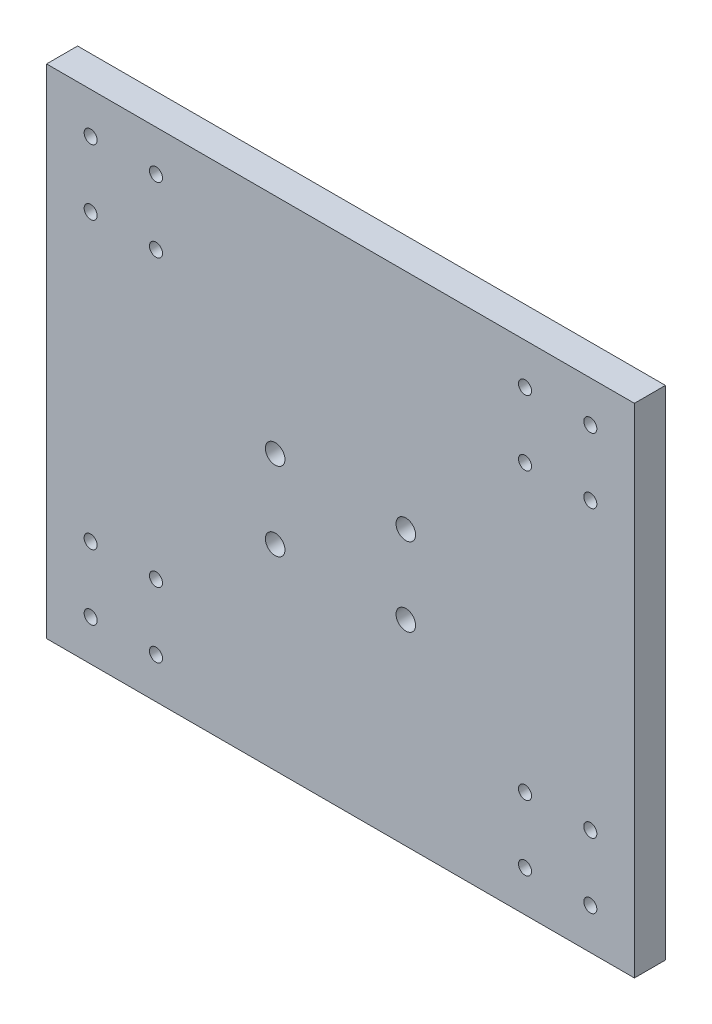
ISO-10303-21;
HEADER;
FILE_DESCRIPTION(('STEP AP214'),'2;1');
FILE_NAME('part.step','',(''),(''),'','','');
FILE_SCHEMA(('AUTOMOTIVE_DESIGN { 1 0 10303 214 1 1 1 1 }'));
ENDSEC;
DATA;
#1=APPLICATION_CONTEXT('core data for automotive mechanical design processes');
#2=APPLICATION_PROTOCOL_DEFINITION('international standard','automotive_design',2000,#1);
#3=PRODUCT_CONTEXT('',#1,'mechanical');
#4=PRODUCT('Part','Part','',(#3));
#5=PRODUCT_RELATED_PRODUCT_CATEGORY('part','',(#4));
#6=PRODUCT_DEFINITION_FORMATION('','',#4);
#7=PRODUCT_DEFINITION_CONTEXT('part definition',#1,'design');
#8=PRODUCT_DEFINITION('design','',#6,#7);
#9=PRODUCT_DEFINITION_SHAPE('','',#8);
#10=(LENGTH_UNIT() NAMED_UNIT(*) SI_UNIT(.MILLI.,.METRE.));
#11=(NAMED_UNIT(*) PLANE_ANGLE_UNIT() SI_UNIT($,.RADIAN.));
#12=(NAMED_UNIT(*) SI_UNIT($,.STERADIAN.) SOLID_ANGLE_UNIT());
#13=UNCERTAINTY_MEASURE_WITH_UNIT(LENGTH_MEASURE(1.E-05),#10,'distance_accuracy_value','');
#14=(GEOMETRIC_REPRESENTATION_CONTEXT(3) GLOBAL_UNCERTAINTY_ASSIGNED_CONTEXT((#13)) GLOBAL_UNIT_ASSIGNED_CONTEXT((#10,
#11,#12)) REPRESENTATION_CONTEXT('',''));
#15=CARTESIAN_POINT('',(0.,0.,0.));
#16=DIRECTION('',(0.,0.,1.));
#17=DIRECTION('',(1.,0.,0.));
#18=AXIS2_PLACEMENT_3D('',#15,#16,#17);
#19=CARTESIAN_POINT('',(90.,-76.2,9.5));
#20=DIRECTION('',(-1.,0.,0.));
#21=DIRECTION('',(0.,0.,1.));
#22=AXIS2_PLACEMENT_3D('',#19,#20,#21);
#23=PLANE('',#22);
#24=DIRECTION('',(0.,1.,0.));
#25=VECTOR('',#24,1.);
#26=CARTESIAN_POINT('',(90.,-76.2,0.));
#27=LINE('',#26,#25);
#28=CARTESIAN_POINT('',(90.,-76.2,0.));
#29=VERTEX_POINT('',#28);
#30=CARTESIAN_POINT('',(90.,76.2,0.));
#31=VERTEX_POINT('',#30);
#32=EDGE_CURVE('E97',#29,#31,#27,.T.);
#33=ORIENTED_EDGE('',*,*,#32,.T.);
#34=DIRECTION('',(0.,0.,-1.));
#35=VECTOR('',#34,1.);
#36=CARTESIAN_POINT('',(90.,76.2,9.5));
#37=LINE('',#36,#35);
#38=CARTESIAN_POINT('',(90.,76.2,9.5));
#39=VERTEX_POINT('',#38);
#40=EDGE_CURVE('E11',#39,#31,#37,.T.);
#41=ORIENTED_EDGE('',*,*,#40,.F.);
#42=DIRECTION('',(0.,1.,0.));
#43=VECTOR('',#42,1.);
#44=CARTESIAN_POINT('',(90.,-76.2,9.5));
#45=LINE('',#44,#43);
#46=CARTESIAN_POINT('',(90.,-76.2,9.5));
#47=VERTEX_POINT('',#46);
#48=EDGE_CURVE('E85',#47,#39,#45,.T.);
#49=ORIENTED_EDGE('',*,*,#48,.F.);
#50=DIRECTION('',(0.,0.,-1.));
#51=VECTOR('',#50,1.);
#52=CARTESIAN_POINT('',(90.,-76.2,9.5));
#53=LINE('',#52,#51);
#54=EDGE_CURVE('E93',#47,#29,#53,.T.);
#55=ORIENTED_EDGE('',*,*,#54,.T.);
#56=EDGE_LOOP('',(#33,#41,#49,#55));
#57=FACE_BOUND('',#56,.T.);
#58=ADVANCED_FACE('F34',(#57),#23,.F.);
#59=CARTESIAN_POINT('',(-90.,76.2,9.5));
#60=DIRECTION('',(0.,-1.,0.));
#61=DIRECTION('',(0.,0.,-1.));
#62=AXIS2_PLACEMENT_3D('',#59,#60,#61);
#63=PLANE('',#62);
#64=DIRECTION('',(-1.,0.,0.));
#65=VECTOR('',#64,1.);
#66=CARTESIAN_POINT('',(-90.,76.2,0.));
#67=LINE('',#66,#65);
#68=CARTESIAN_POINT('',(-90.,76.2,0.));
#69=VERTEX_POINT('',#68);
#70=EDGE_CURVE('E89',#31,#69,#67,.T.);
#71=ORIENTED_EDGE('',*,*,#70,.T.);
#72=DIRECTION('',(0.,0.,-1.));
#73=VECTOR('',#72,1.);
#74=CARTESIAN_POINT('',(-90.,76.2,9.5));
#75=LINE('',#74,#73);
#76=CARTESIAN_POINT('',(-90.,76.2,9.5));
#77=VERTEX_POINT('',#76);
#78=EDGE_CURVE('E42',#77,#69,#75,.T.);
#79=ORIENTED_EDGE('',*,*,#78,.F.);
#80=DIRECTION('',(-1.,0.,0.));
#81=VECTOR('',#80,1.);
#82=CARTESIAN_POINT('',(-90.,76.2,9.5));
#83=LINE('',#82,#81);
#84=EDGE_CURVE('E80',#39,#77,#83,.T.);
#85=ORIENTED_EDGE('',*,*,#84,.F.);
#86=ORIENTED_EDGE('',*,*,#40,.T.);
#87=EDGE_LOOP('',(#71,#79,#85,#86));
#88=FACE_BOUND('',#87,.T.);
#89=ADVANCED_FACE('F88',(#88),#63,.F.);
#90=CARTESIAN_POINT('',(-90.,-76.2,9.5));
#91=DIRECTION('',(1.,0.,0.));
#92=DIRECTION('',(0.,0.,-1.));
#93=AXIS2_PLACEMENT_3D('',#90,#91,#92);
#94=PLANE('',#93);
#95=DIRECTION('',(0.,-1.,0.));
#96=VECTOR('',#95,1.);
#97=CARTESIAN_POINT('',(-90.,-76.2,0.));
#98=LINE('',#97,#96);
#99=CARTESIAN_POINT('',(-90.,-76.2,0.));
#100=VERTEX_POINT('',#99);
#101=EDGE_CURVE('E67',#69,#100,#98,.T.);
#102=ORIENTED_EDGE('',*,*,#101,.T.);
#103=DIRECTION('',(0.,0.,-1.));
#104=VECTOR('',#103,1.);
#105=CARTESIAN_POINT('',(-90.,-76.2,9.5));
#106=LINE('',#105,#104);
#107=CARTESIAN_POINT('',(-90.,-76.2,9.5));
#108=VERTEX_POINT('',#107);
#109=EDGE_CURVE('E90',#108,#100,#106,.T.);
#110=ORIENTED_EDGE('',*,*,#109,.F.);
#111=DIRECTION('',(0.,-1.,0.));
#112=VECTOR('',#111,1.);
#113=CARTESIAN_POINT('',(-90.,-76.2,9.5));
#114=LINE('',#113,#112);
#115=EDGE_CURVE('E83',#77,#108,#114,.T.);
#116=ORIENTED_EDGE('',*,*,#115,.F.);
#117=ORIENTED_EDGE('',*,*,#78,.T.);
#118=EDGE_LOOP('',(#102,#110,#116,#117));
#119=FACE_BOUND('',#118,.T.);
#120=ADVANCED_FACE('F91',(#119),#94,.F.);
#121=CARTESIAN_POINT('',(-90.,-76.2,9.5));
#122=DIRECTION('',(0.,1.,0.));
#123=DIRECTION('',(0.,0.,1.));
#124=AXIS2_PLACEMENT_3D('',#121,#122,#123);
#125=PLANE('',#124);
#126=DIRECTION('',(1.,0.,0.));
#127=VECTOR('',#126,1.);
#128=CARTESIAN_POINT('',(-90.,-76.2,0.));
#129=LINE('',#128,#127);
#130=EDGE_CURVE('E73',#100,#29,#129,.T.);
#131=ORIENTED_EDGE('',*,*,#130,.T.);
#132=ORIENTED_EDGE('',*,*,#54,.F.);
#133=DIRECTION('',(1.,0.,0.));
#134=VECTOR('',#133,1.);
#135=CARTESIAN_POINT('',(-90.,-76.2,9.5));
#136=LINE('',#135,#134);
#137=EDGE_CURVE('E50',#108,#47,#136,.T.);
#138=ORIENTED_EDGE('',*,*,#137,.F.);
#139=ORIENTED_EDGE('',*,*,#109,.T.);
#140=EDGE_LOOP('',(#131,#132,#138,#139));
#141=FACE_BOUND('',#140,.T.);
#142=ADVANCED_FACE('F105',(#141),#125,.F.);
#143=CARTESIAN_POINT('',(0.,0.,9.5));
#144=DIRECTION('',(0.,0.,-1.));
#145=DIRECTION('',(-1.,0.,0.));
#146=AXIS2_PLACEMENT_3D('',#143,#144,#145);
#147=PLANE('',#146);
#148=CARTESIAN_POINT('',(76.4999999999999,63.7,9.5));
#149=DIRECTION('',(0.,0.,1.));
#150=DIRECTION('',(1.,0.,0.));
#151=AXIS2_PLACEMENT_3D('',#148,#149,#150);
#152=CIRCLE('',#151,2.);
#153=CARTESIAN_POINT('',(78.4999999999999,63.7,9.5));
#154=VERTEX_POINT('',#153);
#155=EDGE_CURVE('E196',#154,#154,#152,.T.);
#156=ORIENTED_EDGE('',*,*,#155,.F.);
#157=EDGE_LOOP('',(#156));
#158=FACE_BOUND('',#157,.T.);
#159=CARTESIAN_POINT('',(56.5,63.7,9.5));
#160=DIRECTION('',(0.,0.,1.));
#161=DIRECTION('',(1.,0.,0.));
#162=AXIS2_PLACEMENT_3D('',#159,#160,#161);
#163=CIRCLE('',#162,2.);
#164=CARTESIAN_POINT('',(58.5,63.7,9.5));
#165=VERTEX_POINT('',#164);
#166=EDGE_CURVE('E178',#165,#165,#163,.T.);
#167=ORIENTED_EDGE('',*,*,#166,.F.);
#168=EDGE_LOOP('',(#167));
#169=FACE_BOUND('',#168,.T.);
#170=CARTESIAN_POINT('',(-56.5,43.7,9.5));
#171=DIRECTION('',(0.,0.,1.));
#172=DIRECTION('',(-1.,0.,0.));
#173=AXIS2_PLACEMENT_3D('',#170,#171,#172);
#174=CIRCLE('',#173,2.);
#175=CARTESIAN_POINT('',(-58.5,43.7,9.5));
#176=VERTEX_POINT('',#175);
#177=EDGE_CURVE('E179',#176,#176,#174,.T.);
#178=ORIENTED_EDGE('',*,*,#177,.F.);
#179=EDGE_LOOP('',(#178));
#180=FACE_BOUND('',#179,.T.);
#181=CARTESIAN_POINT('',(-76.4999999999999,63.7,9.5));
#182=DIRECTION('',(0.,0.,1.));
#183=DIRECTION('',(-1.,0.,0.));
#184=AXIS2_PLACEMENT_3D('',#181,#182,#183);
#185=CIRCLE('',#184,2.);
#186=CARTESIAN_POINT('',(-78.4999999999999,63.7,9.5));
#187=VERTEX_POINT('',#186);
#188=EDGE_CURVE('E186',#187,#187,#185,.T.);
#189=ORIENTED_EDGE('',*,*,#188,.F.);
#190=EDGE_LOOP('',(#189));
#191=FACE_BOUND('',#190,.T.);
#192=CARTESIAN_POINT('',(-56.5,63.7,9.5));
#193=DIRECTION('',(0.,0.,1.));
#194=DIRECTION('',(-1.,0.,0.));
#195=AXIS2_PLACEMENT_3D('',#192,#193,#194);
#196=CIRCLE('',#195,2.);
#197=CARTESIAN_POINT('',(-58.5,63.7,9.5));
#198=VERTEX_POINT('',#197);
#199=EDGE_CURVE('E171',#198,#198,#196,.T.);
#200=ORIENTED_EDGE('',*,*,#199,.F.);
#201=EDGE_LOOP('',(#200));
#202=FACE_BOUND('',#201,.T.);
#203=CARTESIAN_POINT('',(-20.,-16.2,9.5));
#204=DIRECTION('',(0.,0.,1.));
#205=DIRECTION('',(1.,0.,0.));
#206=AXIS2_PLACEMENT_3D('',#203,#204,#205);
#207=CIRCLE('',#206,3.);
#208=CARTESIAN_POINT('',(-17.,-16.2,9.5));
#209=VERTEX_POINT('',#208);
#210=EDGE_CURVE('E213',#209,#209,#207,.T.);
#211=ORIENTED_EDGE('',*,*,#210,.F.);
#212=EDGE_LOOP('',(#211));
#213=FACE_BOUND('',#212,.T.);
#214=CARTESIAN_POINT('',(20.,-16.2,9.5));
#215=DIRECTION('',(0.,0.,1.));
#216=DIRECTION('',(1.,0.,0.));
#217=AXIS2_PLACEMENT_3D('',#214,#215,#216);
#218=CIRCLE('',#217,3.);
#219=CARTESIAN_POINT('',(23.,-16.2,9.5));
#220=VERTEX_POINT('',#219);
#221=EDGE_CURVE('E219',#220,#220,#218,.T.);
#222=ORIENTED_EDGE('',*,*,#221,.F.);
#223=EDGE_LOOP('',(#222));
#224=FACE_BOUND('',#223,.T.);
#225=CARTESIAN_POINT('',(20.,7.79999999999999,9.5));
#226=DIRECTION('',(0.,0.,1.));
#227=DIRECTION('',(1.,0.,0.));
#228=AXIS2_PLACEMENT_3D('',#225,#226,#227);
#229=CIRCLE('',#228,2.99999999999999);
#230=CARTESIAN_POINT('',(23.,7.79999999999999,9.5));
#231=VERTEX_POINT('',#230);
#232=EDGE_CURVE('E225',#231,#231,#229,.T.);
#233=ORIENTED_EDGE('',*,*,#232,.F.);
#234=EDGE_LOOP('',(#233));
#235=FACE_BOUND('',#234,.T.);
#236=CARTESIAN_POINT('',(-20.,7.79999999999999,9.5));
#237=DIRECTION('',(0.,0.,1.));
#238=DIRECTION('',(1.,0.,0.));
#239=AXIS2_PLACEMENT_3D('',#236,#237,#238);
#240=CIRCLE('',#239,2.99999999999999);
#241=CARTESIAN_POINT('',(-17.,7.79999999999999,9.5));
#242=VERTEX_POINT('',#241);
#243=EDGE_CURVE('E201',#242,#242,#240,.T.);
#244=ORIENTED_EDGE('',*,*,#243,.F.);
#245=EDGE_LOOP('',(#244));
#246=FACE_BOUND('',#245,.T.);
#247=CARTESIAN_POINT('',(-76.4999999999999,43.7,9.5));
#248=DIRECTION('',(0.,0.,1.));
#249=DIRECTION('',(-1.,0.,0.));
#250=AXIS2_PLACEMENT_3D('',#247,#248,#249);
#251=CIRCLE('',#250,2.);
#252=CARTESIAN_POINT('',(-78.4999999999999,43.7,9.5));
#253=VERTEX_POINT('',#252);
#254=EDGE_CURVE('E208',#253,#253,#251,.T.);
#255=ORIENTED_EDGE('',*,*,#254,.F.);
#256=EDGE_LOOP('',(#255));
#257=FACE_BOUND('',#256,.T.);
#258=CARTESIAN_POINT('',(56.5,-63.7,9.5));
#259=DIRECTION('',(0.,0.,1.));
#260=DIRECTION('',(-1.,0.,0.));
#261=AXIS2_PLACEMENT_3D('',#258,#259,#260);
#262=CIRCLE('',#261,2.);
#263=CARTESIAN_POINT('',(54.5,-63.7,9.5));
#264=VERTEX_POINT('',#263);
#265=EDGE_CURVE('E129',#264,#264,#262,.T.);
#266=ORIENTED_EDGE('',*,*,#265,.F.);
#267=EDGE_LOOP('',(#266));
#268=FACE_BOUND('',#267,.T.);
#269=CARTESIAN_POINT('',(-56.5,-63.7,9.5));
#270=DIRECTION('',(0.,0.,1.));
#271=DIRECTION('',(1.,0.,0.));
#272=AXIS2_PLACEMENT_3D('',#269,#270,#271);
#273=CIRCLE('',#272,2.);
#274=CARTESIAN_POINT('',(-54.5,-63.7,9.5));
#275=VERTEX_POINT('',#274);
#276=EDGE_CURVE('E136',#275,#275,#273,.T.);
#277=ORIENTED_EDGE('',*,*,#276,.F.);
#278=EDGE_LOOP('',(#277));
#279=FACE_BOUND('',#278,.T.);
#280=CARTESIAN_POINT('',(-76.5,-63.7,9.5));
#281=DIRECTION('',(0.,0.,1.));
#282=DIRECTION('',(1.,0.,0.));
#283=AXIS2_PLACEMENT_3D('',#280,#281,#282);
#284=CIRCLE('',#283,2.);
#285=CARTESIAN_POINT('',(-74.5,-63.7,9.5));
#286=VERTEX_POINT('',#285);
#287=EDGE_CURVE('E117',#286,#286,#284,.T.);
#288=ORIENTED_EDGE('',*,*,#287,.F.);
#289=EDGE_LOOP('',(#288));
#290=FACE_BOUND('',#289,.T.);
#291=CARTESIAN_POINT('',(-56.5,-43.7,9.5));
#292=DIRECTION('',(0.,0.,1.));
#293=DIRECTION('',(1.,0.,0.));
#294=AXIS2_PLACEMENT_3D('',#291,#292,#293);
#295=CIRCLE('',#294,2.);
#296=CARTESIAN_POINT('',(-54.5,-43.7,9.5));
#297=VERTEX_POINT('',#296);
#298=EDGE_CURVE('E124',#297,#297,#295,.T.);
#299=ORIENTED_EDGE('',*,*,#298,.F.);
#300=EDGE_LOOP('',(#299));
#301=FACE_BOUND('',#300,.T.);
#302=CARTESIAN_POINT('',(56.5,43.7,9.5));
#303=DIRECTION('',(0.,0.,1.));
#304=DIRECTION('',(1.,0.,0.));
#305=AXIS2_PLACEMENT_3D('',#302,#303,#304);
#306=CIRCLE('',#305,2.);
#307=CARTESIAN_POINT('',(58.5,43.7,9.5));
#308=VERTEX_POINT('',#307);
#309=EDGE_CURVE('E153',#308,#308,#306,.T.);
#310=ORIENTED_EDGE('',*,*,#309,.F.);
#311=EDGE_LOOP('',(#310));
#312=FACE_BOUND('',#311,.T.);
#313=CARTESIAN_POINT('',(76.4999999999999,43.7,9.5));
#314=DIRECTION('',(0.,0.,1.));
#315=DIRECTION('',(1.,0.,0.));
#316=AXIS2_PLACEMENT_3D('',#313,#314,#315);
#317=CIRCLE('',#316,2.);
#318=CARTESIAN_POINT('',(78.4999999999999,43.7,9.5));
#319=VERTEX_POINT('',#318);
#320=EDGE_CURVE('E160',#319,#319,#317,.T.);
#321=ORIENTED_EDGE('',*,*,#320,.F.);
#322=EDGE_LOOP('',(#321));
#323=FACE_BOUND('',#322,.T.);
#324=CARTESIAN_POINT('',(76.5,-43.7,9.5));
#325=DIRECTION('',(0.,0.,1.));
#326=DIRECTION('',(-1.,0.,0.));
#327=AXIS2_PLACEMENT_3D('',#324,#325,#326);
#328=CIRCLE('',#327,2.);
#329=CARTESIAN_POINT('',(74.5,-43.7,9.5));
#330=VERTEX_POINT('',#329);
#331=EDGE_CURVE('E166',#330,#330,#328,.T.);
#332=ORIENTED_EDGE('',*,*,#331,.F.);
#333=EDGE_LOOP('',(#332));
#334=FACE_BOUND('',#333,.T.);
#335=CARTESIAN_POINT('',(56.5,-43.7,9.5));
#336=DIRECTION('',(0.,0.,1.));
#337=DIRECTION('',(-1.,0.,0.));
#338=AXIS2_PLACEMENT_3D('',#335,#336,#337);
#339=CIRCLE('',#338,2.);
#340=CARTESIAN_POINT('',(54.5,-43.7,9.5));
#341=VERTEX_POINT('',#340);
#342=EDGE_CURVE('E141',#341,#341,#339,.T.);
#343=ORIENTED_EDGE('',*,*,#342,.F.);
#344=EDGE_LOOP('',(#343));
#345=FACE_BOUND('',#344,.T.);
#346=CARTESIAN_POINT('',(76.5,-63.7,9.5));
#347=DIRECTION('',(0.,0.,1.));
#348=DIRECTION('',(-1.,0.,0.));
#349=AXIS2_PLACEMENT_3D('',#346,#347,#348);
#350=CIRCLE('',#349,2.);
#351=CARTESIAN_POINT('',(74.5,-63.7,9.5));
#352=VERTEX_POINT('',#351);
#353=EDGE_CURVE('E148',#352,#352,#350,.T.);
#354=ORIENTED_EDGE('',*,*,#353,.F.);
#355=EDGE_LOOP('',(#354));
#356=FACE_BOUND('',#355,.T.);
#357=CARTESIAN_POINT('',(-76.5,-43.7,9.5));
#358=DIRECTION('',(0.,0.,1.));
#359=DIRECTION('',(1.,0.,0.));
#360=AXIS2_PLACEMENT_3D('',#357,#358,#359);
#361=CIRCLE('',#360,2.);
#362=CARTESIAN_POINT('',(-74.5,-43.7,9.5));
#363=VERTEX_POINT('',#362);
#364=EDGE_CURVE('E111',#363,#363,#361,.T.);
#365=ORIENTED_EDGE('',*,*,#364,.F.);
#366=EDGE_LOOP('',(#365));
#367=FACE_BOUND('',#366,.T.);
#368=ORIENTED_EDGE('',*,*,#48,.T.);
#369=ORIENTED_EDGE('',*,*,#84,.T.);
#370=ORIENTED_EDGE('',*,*,#115,.T.);
#371=ORIENTED_EDGE('',*,*,#137,.T.);
#372=EDGE_LOOP('',(#368,#369,#370,#371));
#373=FACE_BOUND('',#372,.T.);
#374=ADVANCED_FACE('F81',(#158,#169,#180,#191,#202,#213,#224,#235,#246,#257,#268,#279,#290,#301,
#312,#323,#334,#345,#356,#367,#373),#147,.F.);
#375=CARTESIAN_POINT('',(0.,0.,0.));
#376=DIRECTION('',(0.,0.,-1.));
#377=DIRECTION('',(-1.,0.,0.));
#378=AXIS2_PLACEMENT_3D('',#375,#376,#377);
#379=PLANE('',#378);
#380=CARTESIAN_POINT('',(76.4999999999999,63.7,0.));
#381=DIRECTION('',(0.,0.,1.));
#382=DIRECTION('',(1.,0.,0.));
#383=AXIS2_PLACEMENT_3D('',#380,#381,#382);
#384=CIRCLE('',#383,2.);
#385=CARTESIAN_POINT('',(78.4999999999999,63.7,0.));
#386=VERTEX_POINT('',#385);
#387=EDGE_CURVE('E157',#386,#386,#384,.T.);
#388=ORIENTED_EDGE('',*,*,#387,.T.);
#389=EDGE_LOOP('',(#388));
#390=FACE_BOUND('',#389,.T.);
#391=CARTESIAN_POINT('',(56.5,63.7,0.));
#392=DIRECTION('',(0.,0.,1.));
#393=DIRECTION('',(1.,0.,0.));
#394=AXIS2_PLACEMENT_3D('',#391,#392,#393);
#395=CIRCLE('',#394,2.);
#396=CARTESIAN_POINT('',(58.5,63.7,0.));
#397=VERTEX_POINT('',#396);
#398=EDGE_CURVE('E193',#397,#397,#395,.T.);
#399=ORIENTED_EDGE('',*,*,#398,.T.);
#400=EDGE_LOOP('',(#399));
#401=FACE_BOUND('',#400,.T.);
#402=CARTESIAN_POINT('',(-56.5,43.7,0.));
#403=DIRECTION('',(0.,0.,1.));
#404=DIRECTION('',(-1.,0.,0.));
#405=AXIS2_PLACEMENT_3D('',#402,#403,#404);
#406=CIRCLE('',#405,2.);
#407=CARTESIAN_POINT('',(-58.5,43.7,0.));
#408=VERTEX_POINT('',#407);
#409=EDGE_CURVE('E182',#408,#408,#406,.T.);
#410=ORIENTED_EDGE('',*,*,#409,.T.);
#411=EDGE_LOOP('',(#410));
#412=FACE_BOUND('',#411,.T.);
#413=CARTESIAN_POINT('',(-76.4999999999999,63.7,0.));
#414=DIRECTION('',(0.,0.,1.));
#415=DIRECTION('',(-1.,0.,0.));
#416=AXIS2_PLACEMENT_3D('',#413,#414,#415);
#417=CIRCLE('',#416,2.);
#418=CARTESIAN_POINT('',(-78.4999999999999,63.7,0.));
#419=VERTEX_POINT('',#418);
#420=EDGE_CURVE('E175',#419,#419,#417,.T.);
#421=ORIENTED_EDGE('',*,*,#420,.T.);
#422=EDGE_LOOP('',(#421));
#423=FACE_BOUND('',#422,.T.);
#424=CARTESIAN_POINT('',(-56.5,63.7,0.));
#425=DIRECTION('',(0.,0.,1.));
#426=DIRECTION('',(-1.,0.,0.));
#427=AXIS2_PLACEMENT_3D('',#424,#425,#426);
#428=CIRCLE('',#427,2.);
#429=CARTESIAN_POINT('',(-58.5,63.7,0.));
#430=VERTEX_POINT('',#429);
#431=EDGE_CURVE('E174',#430,#430,#428,.T.);
#432=ORIENTED_EDGE('',*,*,#431,.T.);
#433=EDGE_LOOP('',(#432));
#434=FACE_BOUND('',#433,.T.);
#435=CARTESIAN_POINT('',(-20.,-16.2,0.));
#436=DIRECTION('',(0.,0.,1.));
#437=DIRECTION('',(1.,0.,0.));
#438=AXIS2_PLACEMENT_3D('',#435,#436,#437);
#439=CIRCLE('',#438,3.);
#440=CARTESIAN_POINT('',(-17.,-16.2,0.));
#441=VERTEX_POINT('',#440);
#442=EDGE_CURVE('E216',#441,#441,#439,.T.);
#443=ORIENTED_EDGE('',*,*,#442,.T.);
#444=EDGE_LOOP('',(#443));
#445=FACE_BOUND('',#444,.T.);
#446=CARTESIAN_POINT('',(20.,-16.2,0.));
#447=DIRECTION('',(0.,0.,1.));
#448=DIRECTION('',(1.,0.,0.));
#449=AXIS2_PLACEMENT_3D('',#446,#447,#448);
#450=CIRCLE('',#449,3.);
#451=CARTESIAN_POINT('',(23.,-16.2,0.));
#452=VERTEX_POINT('',#451);
#453=EDGE_CURVE('E222',#452,#452,#450,.T.);
#454=ORIENTED_EDGE('',*,*,#453,.T.);
#455=EDGE_LOOP('',(#454));
#456=FACE_BOUND('',#455,.T.);
#457=CARTESIAN_POINT('',(20.,7.79999999999999,0.));
#458=DIRECTION('',(0.,0.,1.));
#459=DIRECTION('',(1.,0.,0.));
#460=AXIS2_PLACEMENT_3D('',#457,#458,#459);
#461=CIRCLE('',#460,2.99999999999999);
#462=CARTESIAN_POINT('',(23.,7.79999999999999,0.));
#463=VERTEX_POINT('',#462);
#464=EDGE_CURVE('E205',#463,#463,#461,.T.);
#465=ORIENTED_EDGE('',*,*,#464,.T.);
#466=EDGE_LOOP('',(#465));
#467=FACE_BOUND('',#466,.T.);
#468=CARTESIAN_POINT('',(-20.,7.79999999999999,0.));
#469=DIRECTION('',(0.,0.,1.));
#470=DIRECTION('',(1.,0.,0.));
#471=AXIS2_PLACEMENT_3D('',#468,#469,#470);
#472=CIRCLE('',#471,2.99999999999999);
#473=CARTESIAN_POINT('',(-17.,7.79999999999999,0.));
#474=VERTEX_POINT('',#473);
#475=EDGE_CURVE('E204',#474,#474,#472,.T.);
#476=ORIENTED_EDGE('',*,*,#475,.T.);
#477=EDGE_LOOP('',(#476));
#478=FACE_BOUND('',#477,.T.);
#479=CARTESIAN_POINT('',(-76.4999999999999,43.7,0.));
#480=DIRECTION('',(0.,0.,1.));
#481=DIRECTION('',(-1.,0.,0.));
#482=AXIS2_PLACEMENT_3D('',#479,#480,#481);
#483=CIRCLE('',#482,2.);
#484=CARTESIAN_POINT('',(-78.4999999999999,43.7,0.));
#485=VERTEX_POINT('',#484);
#486=EDGE_CURVE('E183',#485,#485,#483,.T.);
#487=ORIENTED_EDGE('',*,*,#486,.T.);
#488=EDGE_LOOP('',(#487));
#489=FACE_BOUND('',#488,.T.);
#490=CARTESIAN_POINT('',(56.5,-63.7,0.));
#491=DIRECTION('',(0.,0.,1.));
#492=DIRECTION('',(-1.,0.,0.));
#493=AXIS2_PLACEMENT_3D('',#490,#491,#492);
#494=CIRCLE('',#493,2.);
#495=CARTESIAN_POINT('',(54.5,-63.7,0.));
#496=VERTEX_POINT('',#495);
#497=EDGE_CURVE('E132',#496,#496,#494,.T.);
#498=ORIENTED_EDGE('',*,*,#497,.T.);
#499=EDGE_LOOP('',(#498));
#500=FACE_BOUND('',#499,.T.);
#501=CARTESIAN_POINT('',(-56.5,-63.7,0.));
#502=DIRECTION('',(0.,0.,1.));
#503=DIRECTION('',(1.,0.,0.));
#504=AXIS2_PLACEMENT_3D('',#501,#502,#503);
#505=CIRCLE('',#504,2.);
#506=CARTESIAN_POINT('',(-54.5,-63.7,0.));
#507=VERTEX_POINT('',#506);
#508=EDGE_CURVE('E121',#507,#507,#505,.T.);
#509=ORIENTED_EDGE('',*,*,#508,.T.);
#510=EDGE_LOOP('',(#509));
#511=FACE_BOUND('',#510,.T.);
#512=CARTESIAN_POINT('',(-76.5,-63.7,0.));
#513=DIRECTION('',(0.,0.,1.));
#514=DIRECTION('',(1.,0.,0.));
#515=AXIS2_PLACEMENT_3D('',#512,#513,#514);
#516=CIRCLE('',#515,2.);
#517=CARTESIAN_POINT('',(-74.5,-63.7,0.));
#518=VERTEX_POINT('',#517);
#519=EDGE_CURVE('E120',#518,#518,#516,.T.);
#520=ORIENTED_EDGE('',*,*,#519,.T.);
#521=EDGE_LOOP('',(#520));
#522=FACE_BOUND('',#521,.T.);
#523=CARTESIAN_POINT('',(-56.5,-43.7,0.));
#524=DIRECTION('',(0.,0.,1.));
#525=DIRECTION('',(1.,0.,0.));
#526=AXIS2_PLACEMENT_3D('',#523,#524,#525);
#527=CIRCLE('',#526,2.);
#528=CARTESIAN_POINT('',(-54.5,-43.7,0.));
#529=VERTEX_POINT('',#528);
#530=EDGE_CURVE('E114',#529,#529,#527,.T.);
#531=ORIENTED_EDGE('',*,*,#530,.T.);
#532=EDGE_LOOP('',(#531));
#533=FACE_BOUND('',#532,.T.);
#534=CARTESIAN_POINT('',(56.5,43.7,0.));
#535=DIRECTION('',(0.,0.,1.));
#536=DIRECTION('',(1.,0.,0.));
#537=AXIS2_PLACEMENT_3D('',#534,#535,#536);
#538=CIRCLE('',#537,2.);
#539=CARTESIAN_POINT('',(58.5,43.7,0.));
#540=VERTEX_POINT('',#539);
#541=EDGE_CURVE('E156',#540,#540,#538,.T.);
#542=ORIENTED_EDGE('',*,*,#541,.T.);
#543=EDGE_LOOP('',(#542));
#544=FACE_BOUND('',#543,.T.);
#545=CARTESIAN_POINT('',(76.4999999999999,43.7,0.));
#546=DIRECTION('',(0.,0.,1.));
#547=DIRECTION('',(1.,0.,0.));
#548=AXIS2_PLACEMENT_3D('',#545,#546,#547);
#549=CIRCLE('',#548,2.);
#550=CARTESIAN_POINT('',(78.4999999999999,43.7,0.));
#551=VERTEX_POINT('',#550);
#552=EDGE_CURVE('E163',#551,#551,#549,.T.);
#553=ORIENTED_EDGE('',*,*,#552,.T.);
#554=EDGE_LOOP('',(#553));
#555=FACE_BOUND('',#554,.T.);
#556=CARTESIAN_POINT('',(76.5,-43.7,0.));
#557=DIRECTION('',(0.,0.,1.));
#558=DIRECTION('',(-1.,0.,0.));
#559=AXIS2_PLACEMENT_3D('',#556,#557,#558);
#560=CIRCLE('',#559,2.);
#561=CARTESIAN_POINT('',(74.5,-43.7,0.));
#562=VERTEX_POINT('',#561);
#563=EDGE_CURVE('E145',#562,#562,#560,.T.);
#564=ORIENTED_EDGE('',*,*,#563,.T.);
#565=EDGE_LOOP('',(#564));
#566=FACE_BOUND('',#565,.T.);
#567=CARTESIAN_POINT('',(56.5,-43.7,0.));
#568=DIRECTION('',(0.,0.,1.));
#569=DIRECTION('',(-1.,0.,0.));
#570=AXIS2_PLACEMENT_3D('',#567,#568,#569);
#571=CIRCLE('',#570,2.);
#572=CARTESIAN_POINT('',(54.5,-43.7,0.));
#573=VERTEX_POINT('',#572);
#574=EDGE_CURVE('E144',#573,#573,#571,.T.);
#575=ORIENTED_EDGE('',*,*,#574,.T.);
#576=EDGE_LOOP('',(#575));
#577=FACE_BOUND('',#576,.T.);
#578=CARTESIAN_POINT('',(76.5,-63.7,0.));
#579=DIRECTION('',(0.,0.,1.));
#580=DIRECTION('',(-1.,0.,0.));
#581=AXIS2_PLACEMENT_3D('',#578,#579,#580);
#582=CIRCLE('',#581,2.);
#583=CARTESIAN_POINT('',(74.5,-63.7,0.));
#584=VERTEX_POINT('',#583);
#585=EDGE_CURVE('E133',#584,#584,#582,.T.);
#586=ORIENTED_EDGE('',*,*,#585,.T.);
#587=EDGE_LOOP('',(#586));
#588=FACE_BOUND('',#587,.T.);
#589=CARTESIAN_POINT('',(-76.5,-43.7,0.));
#590=DIRECTION('',(0.,0.,1.));
#591=DIRECTION('',(1.,0.,0.));
#592=AXIS2_PLACEMENT_3D('',#589,#590,#591);
#593=CIRCLE('',#592,2.);
#594=CARTESIAN_POINT('',(-74.5,-43.7,0.));
#595=VERTEX_POINT('',#594);
#596=EDGE_CURVE('E100',#595,#595,#593,.T.);
#597=ORIENTED_EDGE('',*,*,#596,.T.);
#598=EDGE_LOOP('',(#597));
#599=FACE_BOUND('',#598,.T.);
#600=ORIENTED_EDGE('',*,*,#32,.F.);
#601=ORIENTED_EDGE('',*,*,#130,.F.);
#602=ORIENTED_EDGE('',*,*,#101,.F.);
#603=ORIENTED_EDGE('',*,*,#70,.F.);
#604=EDGE_LOOP('',(#600,#601,#602,#603));
#605=FACE_BOUND('',#604,.T.);
#606=ADVANCED_FACE('F108',(#390,#401,#412,#423,#434,#445,#456,#467,#478,#489,#500,#511,#522,
#533,#544,#555,#566,#577,#588,#599,#605),#379,.T.);
#607=CARTESIAN_POINT('',(-76.5,-43.7,0.));
#608=DIRECTION('',(0.,0.,1.));
#609=DIRECTION('',(1.,0.,0.));
#610=AXIS2_PLACEMENT_3D('',#607,#608,#609);
#611=CYLINDRICAL_SURFACE('',#610,2.);
#612=ORIENTED_EDGE('',*,*,#596,.F.);
#613=EDGE_LOOP('',(#612));
#614=FACE_BOUND('',#613,.T.);
#615=ORIENTED_EDGE('',*,*,#364,.T.);
#616=EDGE_LOOP('',(#615));
#617=FACE_BOUND('',#616,.T.);
#618=ADVANCED_FACE('F269',(#614,#617),#611,.F.);
#619=CARTESIAN_POINT('',(76.5,-63.7,0.));
#620=DIRECTION('',(0.,0.,1.));
#621=DIRECTION('',(1.,0.,0.));
#622=AXIS2_PLACEMENT_3D('',#619,#620,#621);
#623=CYLINDRICAL_SURFACE('',#622,2.);
#624=ORIENTED_EDGE('',*,*,#585,.F.);
#625=EDGE_LOOP('',(#624));
#626=FACE_BOUND('',#625,.T.);
#627=ORIENTED_EDGE('',*,*,#353,.T.);
#628=EDGE_LOOP('',(#627));
#629=FACE_BOUND('',#628,.T.);
#630=ADVANCED_FACE('F271',(#626,#629),#623,.F.);
#631=CARTESIAN_POINT('',(56.5,-43.7,0.));
#632=DIRECTION('',(0.,0.,1.));
#633=DIRECTION('',(1.,0.,0.));
#634=AXIS2_PLACEMENT_3D('',#631,#632,#633);
#635=CYLINDRICAL_SURFACE('',#634,2.);
#636=ORIENTED_EDGE('',*,*,#574,.F.);
#637=EDGE_LOOP('',(#636));
#638=FACE_BOUND('',#637,.T.);
#639=ORIENTED_EDGE('',*,*,#342,.T.);
#640=EDGE_LOOP('',(#639));
#641=FACE_BOUND('',#640,.T.);
#642=ADVANCED_FACE('F278',(#638,#641),#635,.F.);
#643=CARTESIAN_POINT('',(76.5,-43.7,0.));
#644=DIRECTION('',(0.,0.,1.));
#645=DIRECTION('',(1.,0.,0.));
#646=AXIS2_PLACEMENT_3D('',#643,#644,#645);
#647=CYLINDRICAL_SURFACE('',#646,2.);
#648=ORIENTED_EDGE('',*,*,#563,.F.);
#649=EDGE_LOOP('',(#648));
#650=FACE_BOUND('',#649,.T.);
#651=ORIENTED_EDGE('',*,*,#331,.T.);
#652=EDGE_LOOP('',(#651));
#653=FACE_BOUND('',#652,.T.);
#654=ADVANCED_FACE('F326',(#650,#653),#647,.F.);
#655=CARTESIAN_POINT('',(76.4999999999999,43.7,0.));
#656=DIRECTION('',(0.,0.,1.));
#657=DIRECTION('',(1.,0.,0.));
#658=AXIS2_PLACEMENT_3D('',#655,#656,#657);
#659=CYLINDRICAL_SURFACE('',#658,2.);
#660=ORIENTED_EDGE('',*,*,#552,.F.);
#661=EDGE_LOOP('',(#660));
#662=FACE_BOUND('',#661,.T.);
#663=ORIENTED_EDGE('',*,*,#320,.T.);
#664=EDGE_LOOP('',(#663));
#665=FACE_BOUND('',#664,.T.);
#666=ADVANCED_FACE('F336',(#662,#665),#659,.F.);
#667=CARTESIAN_POINT('',(56.5,43.7,0.));
#668=DIRECTION('',(0.,0.,1.));
#669=DIRECTION('',(1.,0.,0.));
#670=AXIS2_PLACEMENT_3D('',#667,#668,#669);
#671=CYLINDRICAL_SURFACE('',#670,2.);
#672=ORIENTED_EDGE('',*,*,#541,.F.);
#673=EDGE_LOOP('',(#672));
#674=FACE_BOUND('',#673,.T.);
#675=ORIENTED_EDGE('',*,*,#309,.T.);
#676=EDGE_LOOP('',(#675));
#677=FACE_BOUND('',#676,.T.);
#678=ADVANCED_FACE('F346',(#674,#677),#671,.F.);
#679=CARTESIAN_POINT('',(-56.5,-43.7,0.));
#680=DIRECTION('',(0.,0.,1.));
#681=DIRECTION('',(1.,0.,0.));
#682=AXIS2_PLACEMENT_3D('',#679,#680,#681);
#683=CYLINDRICAL_SURFACE('',#682,2.);
#684=ORIENTED_EDGE('',*,*,#530,.F.);
#685=EDGE_LOOP('',(#684));
#686=FACE_BOUND('',#685,.T.);
#687=ORIENTED_EDGE('',*,*,#298,.T.);
#688=EDGE_LOOP('',(#687));
#689=FACE_BOUND('',#688,.T.);
#690=ADVANCED_FACE('F356',(#686,#689),#683,.F.);
#691=CARTESIAN_POINT('',(-76.5,-63.7,0.));
#692=DIRECTION('',(0.,0.,1.));
#693=DIRECTION('',(1.,0.,0.));
#694=AXIS2_PLACEMENT_3D('',#691,#692,#693);
#695=CYLINDRICAL_SURFACE('',#694,2.);
#696=ORIENTED_EDGE('',*,*,#519,.F.);
#697=EDGE_LOOP('',(#696));
#698=FACE_BOUND('',#697,.T.);
#699=ORIENTED_EDGE('',*,*,#287,.T.);
#700=EDGE_LOOP('',(#699));
#701=FACE_BOUND('',#700,.T.);
#702=ADVANCED_FACE('F366',(#698,#701),#695,.F.);
#703=CARTESIAN_POINT('',(-56.5,-63.7,0.));
#704=DIRECTION('',(0.,0.,1.));
#705=DIRECTION('',(1.,0.,0.));
#706=AXIS2_PLACEMENT_3D('',#703,#704,#705);
#707=CYLINDRICAL_SURFACE('',#706,2.);
#708=ORIENTED_EDGE('',*,*,#508,.F.);
#709=EDGE_LOOP('',(#708));
#710=FACE_BOUND('',#709,.T.);
#711=ORIENTED_EDGE('',*,*,#276,.T.);
#712=EDGE_LOOP('',(#711));
#713=FACE_BOUND('',#712,.T.);
#714=ADVANCED_FACE('F376',(#710,#713),#707,.F.);
#715=CARTESIAN_POINT('',(56.5,-63.7,0.));
#716=DIRECTION('',(0.,0.,1.));
#717=DIRECTION('',(1.,0.,0.));
#718=AXIS2_PLACEMENT_3D('',#715,#716,#717);
#719=CYLINDRICAL_SURFACE('',#718,2.);
#720=ORIENTED_EDGE('',*,*,#497,.F.);
#721=EDGE_LOOP('',(#720));
#722=FACE_BOUND('',#721,.T.);
#723=ORIENTED_EDGE('',*,*,#265,.T.);
#724=EDGE_LOOP('',(#723));
#725=FACE_BOUND('',#724,.T.);
#726=ADVANCED_FACE('F385',(#722,#725),#719,.F.);
#727=CARTESIAN_POINT('',(-76.4999999999999,43.7,0.));
#728=DIRECTION('',(0.,0.,1.));
#729=DIRECTION('',(1.,0.,0.));
#730=AXIS2_PLACEMENT_3D('',#727,#728,#729);
#731=CYLINDRICAL_SURFACE('',#730,2.);
#732=ORIENTED_EDGE('',*,*,#486,.F.);
#733=EDGE_LOOP('',(#732));
#734=FACE_BOUND('',#733,.T.);
#735=ORIENTED_EDGE('',*,*,#254,.T.);
#736=EDGE_LOOP('',(#735));
#737=FACE_BOUND('',#736,.T.);
#738=ADVANCED_FACE('F395',(#734,#737),#731,.F.);
#739=CARTESIAN_POINT('',(-20.,7.79999999999999,0.));
#740=DIRECTION('',(0.,0.,1.));
#741=DIRECTION('',(1.,0.,0.));
#742=AXIS2_PLACEMENT_3D('',#739,#740,#741);
#743=CYLINDRICAL_SURFACE('',#742,2.99999999999999);
#744=ORIENTED_EDGE('',*,*,#475,.F.);
#745=EDGE_LOOP('',(#744));
#746=FACE_BOUND('',#745,.T.);
#747=ORIENTED_EDGE('',*,*,#243,.T.);
#748=EDGE_LOOP('',(#747));
#749=FACE_BOUND('',#748,.T.);
#750=ADVANCED_FACE('F237',(#746,#749),#743,.F.);
#751=CARTESIAN_POINT('',(20.,7.79999999999999,0.));
#752=DIRECTION('',(0.,0.,1.));
#753=DIRECTION('',(1.,0.,0.));
#754=AXIS2_PLACEMENT_3D('',#751,#752,#753);
#755=CYLINDRICAL_SURFACE('',#754,2.99999999999999);
#756=ORIENTED_EDGE('',*,*,#464,.F.);
#757=EDGE_LOOP('',(#756));
#758=FACE_BOUND('',#757,.T.);
#759=ORIENTED_EDGE('',*,*,#232,.T.);
#760=EDGE_LOOP('',(#759));
#761=FACE_BOUND('',#760,.T.);
#762=ADVANCED_FACE('F233',(#758,#761),#755,.F.);
#763=CARTESIAN_POINT('',(20.,-16.2,0.));
#764=DIRECTION('',(0.,0.,1.));
#765=DIRECTION('',(1.,0.,0.));
#766=AXIS2_PLACEMENT_3D('',#763,#764,#765);
#767=CYLINDRICAL_SURFACE('',#766,3.);
#768=ORIENTED_EDGE('',*,*,#453,.F.);
#769=EDGE_LOOP('',(#768));
#770=FACE_BOUND('',#769,.T.);
#771=ORIENTED_EDGE('',*,*,#221,.T.);
#772=EDGE_LOOP('',(#771));
#773=FACE_BOUND('',#772,.T.);
#774=ADVANCED_FACE('F236',(#770,#773),#767,.F.);
#775=CARTESIAN_POINT('',(-20.,-16.2,0.));
#776=DIRECTION('',(0.,0.,1.));
#777=DIRECTION('',(1.,0.,0.));
#778=AXIS2_PLACEMENT_3D('',#775,#776,#777);
#779=CYLINDRICAL_SURFACE('',#778,3.);
#780=ORIENTED_EDGE('',*,*,#442,.F.);
#781=EDGE_LOOP('',(#780));
#782=FACE_BOUND('',#781,.T.);
#783=ORIENTED_EDGE('',*,*,#210,.T.);
#784=EDGE_LOOP('',(#783));
#785=FACE_BOUND('',#784,.T.);
#786=ADVANCED_FACE('F429',(#782,#785),#779,.F.);
#787=CARTESIAN_POINT('',(-56.5,63.7,0.));
#788=DIRECTION('',(0.,0.,1.));
#789=DIRECTION('',(1.,0.,0.));
#790=AXIS2_PLACEMENT_3D('',#787,#788,#789);
#791=CYLINDRICAL_SURFACE('',#790,2.);
#792=ORIENTED_EDGE('',*,*,#431,.F.);
#793=EDGE_LOOP('',(#792));
#794=FACE_BOUND('',#793,.T.);
#795=ORIENTED_EDGE('',*,*,#199,.T.);
#796=EDGE_LOOP('',(#795));
#797=FACE_BOUND('',#796,.T.);
#798=ADVANCED_FACE('F439',(#794,#797),#791,.F.);
#799=CARTESIAN_POINT('',(-76.4999999999999,63.7,0.));
#800=DIRECTION('',(0.,0.,1.));
#801=DIRECTION('',(1.,0.,0.));
#802=AXIS2_PLACEMENT_3D('',#799,#800,#801);
#803=CYLINDRICAL_SURFACE('',#802,2.);
#804=ORIENTED_EDGE('',*,*,#420,.F.);
#805=EDGE_LOOP('',(#804));
#806=FACE_BOUND('',#805,.T.);
#807=ORIENTED_EDGE('',*,*,#188,.T.);
#808=EDGE_LOOP('',(#807));
#809=FACE_BOUND('',#808,.T.);
#810=ADVANCED_FACE('F449',(#806,#809),#803,.F.);
#811=CARTESIAN_POINT('',(-56.5,43.7,0.));
#812=DIRECTION('',(0.,0.,1.));
#813=DIRECTION('',(1.,0.,0.));
#814=AXIS2_PLACEMENT_3D('',#811,#812,#813);
#815=CYLINDRICAL_SURFACE('',#814,2.);
#816=ORIENTED_EDGE('',*,*,#409,.F.);
#817=EDGE_LOOP('',(#816));
#818=FACE_BOUND('',#817,.T.);
#819=ORIENTED_EDGE('',*,*,#177,.T.);
#820=EDGE_LOOP('',(#819));
#821=FACE_BOUND('',#820,.T.);
#822=ADVANCED_FACE('F459',(#818,#821),#815,.F.);
#823=CARTESIAN_POINT('',(56.5,63.7,0.));
#824=DIRECTION('',(0.,0.,1.));
#825=DIRECTION('',(1.,0.,0.));
#826=AXIS2_PLACEMENT_3D('',#823,#824,#825);
#827=CYLINDRICAL_SURFACE('',#826,2.);
#828=ORIENTED_EDGE('',*,*,#398,.F.);
#829=EDGE_LOOP('',(#828));
#830=FACE_BOUND('',#829,.T.);
#831=ORIENTED_EDGE('',*,*,#166,.T.);
#832=EDGE_LOOP('',(#831));
#833=FACE_BOUND('',#832,.T.);
#834=ADVANCED_FACE('F469',(#830,#833),#827,.F.);
#835=CARTESIAN_POINT('',(76.4999999999999,63.7,0.));
#836=DIRECTION('',(0.,0.,1.));
#837=DIRECTION('',(1.,0.,0.));
#838=AXIS2_PLACEMENT_3D('',#835,#836,#837);
#839=CYLINDRICAL_SURFACE('',#838,2.);
#840=ORIENTED_EDGE('',*,*,#387,.F.);
#841=EDGE_LOOP('',(#840));
#842=FACE_BOUND('',#841,.T.);
#843=ORIENTED_EDGE('',*,*,#155,.T.);
#844=EDGE_LOOP('',(#843));
#845=FACE_BOUND('',#844,.T.);
#846=ADVANCED_FACE('F479',(#842,#845),#839,.F.);
#847=CLOSED_SHELL('',(#58,#89,#120,#142,#374,#606,#618,#630,#642,#654,#666,#678,#690,#702,#714,
#726,#738,#750,#762,#774,#786,#798,#810,#822,#834,#846));
#848=MANIFOLD_SOLID_BREP('B2',#847);
#849=ADVANCED_BREP_SHAPE_REPRESENTATION('',(#18,#848),#14);
#850=SHAPE_DEFINITION_REPRESENTATION(#9,#849);
ENDSEC;
END-ISO-10303-21;
